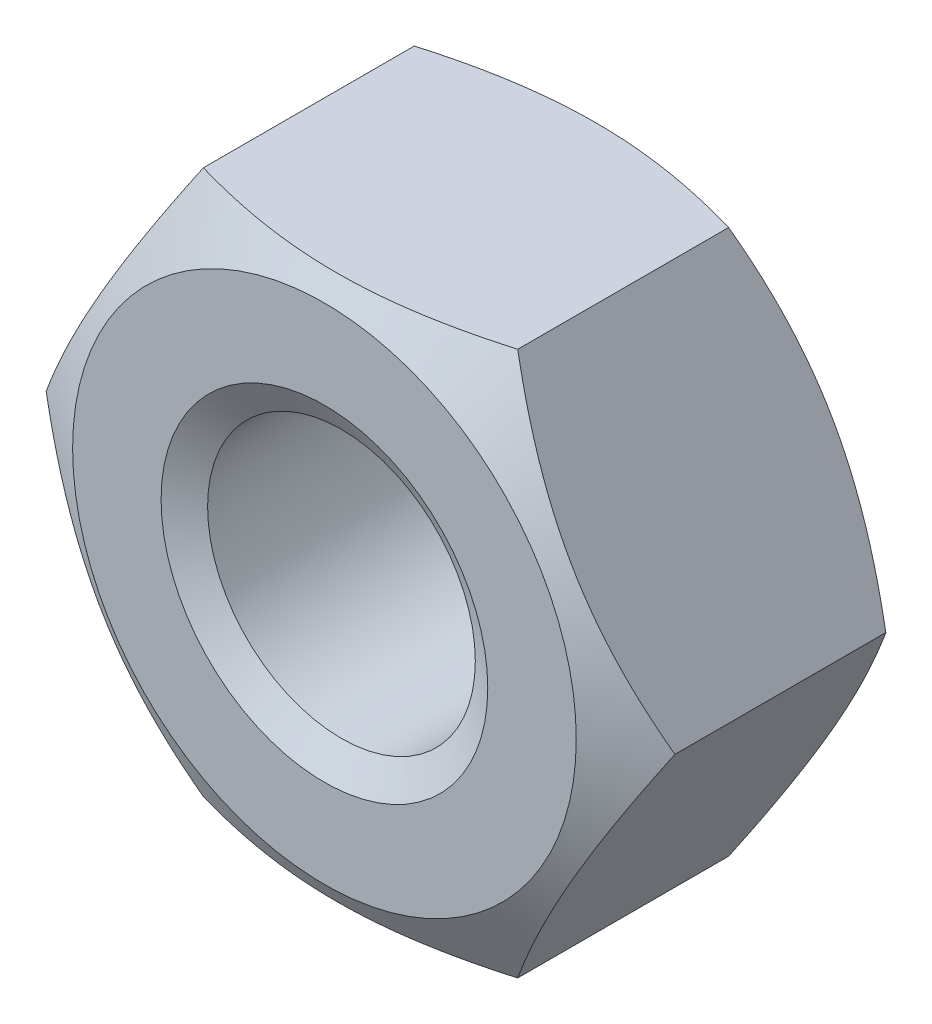
ISO-10303-21;
HEADER;
FILE_DESCRIPTION(('STEP AP214'),'2;1');
FILE_NAME('part.step','',(''),(''),'','','');
FILE_SCHEMA(('AUTOMOTIVE_DESIGN { 1 0 10303 214 1 1 1 1 }'));
ENDSEC;
DATA;
#1=APPLICATION_CONTEXT('core data for automotive mechanical design processes');
#2=APPLICATION_PROTOCOL_DEFINITION('international standard','automotive_design',2000,#1);
#3=PRODUCT_CONTEXT('',#1,'mechanical');
#4=PRODUCT('Part','Part','',(#3));
#5=PRODUCT_RELATED_PRODUCT_CATEGORY('part','',(#4));
#6=PRODUCT_DEFINITION_FORMATION('','',#4);
#7=PRODUCT_DEFINITION_CONTEXT('part definition',#1,'design');
#8=PRODUCT_DEFINITION('design','',#6,#7);
#9=PRODUCT_DEFINITION_SHAPE('','',#8);
#10=(LENGTH_UNIT() NAMED_UNIT(*) SI_UNIT(.MILLI.,.METRE.));
#11=(NAMED_UNIT(*) PLANE_ANGLE_UNIT() SI_UNIT($,.RADIAN.));
#12=(NAMED_UNIT(*) SI_UNIT($,.STERADIAN.) SOLID_ANGLE_UNIT());
#13=UNCERTAINTY_MEASURE_WITH_UNIT(LENGTH_MEASURE(1.E-05),#10,'distance_accuracy_value','');
#14=(GEOMETRIC_REPRESENTATION_CONTEXT(3) GLOBAL_UNCERTAINTY_ASSIGNED_CONTEXT((#13)) GLOBAL_UNIT_ASSIGNED_CONTEXT((#10,
#11,#12)) REPRESENTATION_CONTEXT('',''));
#15=CARTESIAN_POINT('',(0.,0.,0.));
#16=DIRECTION('',(0.,0.,1.));
#17=DIRECTION('',(1.,0.,0.));
#18=AXIS2_PLACEMENT_3D('',#15,#16,#17);
#19=CARTESIAN_POINT('',(2.88675134594813,-5.,-5.2));
#20=DIRECTION('',(0.866025403784439,-0.5,0.));
#21=DIRECTION('',(0.5,0.866025403784439,0.));
#22=AXIS2_PLACEMENT_3D('',#19,#20,#21);
#23=PLANE('',#22);
#24=CARTESIAN_POINT('',(2.88663587589429,-5.0002,-0.663155006997931));
#25=CARTESIAN_POINT('',(3.01349970319368,-4.78046540547481,-0.589892918583738));
#26=CARTESIAN_POINT('',(3.14144859993849,-4.55885141554042,-0.523257672864196));
#27=CARTESIAN_POINT('',(3.39956193532121,-4.11178600454649,-0.406945341956916));
#28=CARTESIAN_POINT('',(3.52973095989718,-3.88632664040923,-0.357309400861895));
#29=CARTESIAN_POINT('',(3.78847564779798,-3.43816769477649,-0.280057376364805));
#30=CARTESIAN_POINT('',(3.91701101576052,-3.21553790689581,-0.251926729229597));
#31=CARTESIAN_POINT('',(4.11026620624323,-2.88081009815336,-0.226701272899792));
#32=CARTESIAN_POINT('',(4.17472868879311,-2.76915780319494,-0.221119810715592));
#33=CARTESIAN_POINT('',(4.30371322717528,-2.5457500293262,-0.215708567697578));
#34=CARTESIAN_POINT('',(4.36823528110589,-2.43399455370969,-0.215878609204311));
#35=CARTESIAN_POINT('',(4.54500768479194,-2.12781576914936,-0.224259982738144));
#36=CARTESIAN_POINT('',(4.65719946015293,-1.93349391403279,-0.238336122843359));
#37=CARTESIAN_POINT('',(4.88083840557981,-1.5461398980023,-0.282971608055538));
#38=CARTESIAN_POINT('',(4.9922847895602,-1.35310909862843,-0.313546211093615));
#39=CARTESIAN_POINT('',(5.21637431361295,-0.964974657525147,-0.38997484456727));
#40=CARTESIAN_POINT('',(5.32898917185759,-0.769920001358265,-0.436152729824786));
#41=CARTESIAN_POINT('',(5.55253939626498,-0.382719654641232,-0.540958145438039));
#42=CARTESIAN_POINT('',(5.66347762579592,-0.190569004591913,-0.599561054383479));
#43=CARTESIAN_POINT('',(5.7736181619501,0.000200000000000737,-0.663155006997933));
#44=B_SPLINE_CURVE_WITH_KNOTS('',3,(#24,#25,#26,#27,#28,#29,#30,#31,#32,#33,#34,#35,#36,#37,#38,
#39,#40,#41,#42,#43),.UNSPECIFIED.,.F.,.F.,(4,2,2,2,2,2,2,2,2,4),(0.,0.792555841363089,
1.58701660053333,2.3618153748728,2.74884076077325,3.13585419177295,3.80962362599679,
4.48401723901189,5.17336882348928,5.86136694793725),.UNSPECIFIED.);
#45=CARTESIAN_POINT('',(2.88675134594813,-5.,-0.663088338331305));
#46=VERTEX_POINT('',#45);
#47=CARTESIAN_POINT('',(5.77350269189626,0.,-0.663088338331305));
#48=VERTEX_POINT('',#47);
#49=EDGE_CURVE('E51',#46,#48,#44,.T.);
#50=ORIENTED_EDGE('',*,*,#49,.F.);
#51=DIRECTION('',(0.,0.,1.));
#52=VECTOR('',#51,1.);
#53=CARTESIAN_POINT('',(2.88675134594813,-5.,-5.2));
#54=LINE('',#53,#52);
#55=CARTESIAN_POINT('',(2.88675134594813,-5.,-4.53691166166869));
#56=VERTEX_POINT('',#55);
#57=EDGE_CURVE('E115',#56,#46,#54,.T.);
#58=ORIENTED_EDGE('',*,*,#57,.F.);
#59=CARTESIAN_POINT('',(5.7736181619501,0.000200000000000384,-4.53684499300207));
#60=CARTESIAN_POINT('',(5.64675433465071,-0.219534594525185,-4.61010708141626));
#61=CARTESIAN_POINT('',(5.5188054379059,-0.44114858445958,-4.6767423271358));
#62=CARTESIAN_POINT('',(5.26069210252318,-0.888213995453513,-4.79305465804308));
#63=CARTESIAN_POINT('',(5.13052307794721,-1.11367335959077,-4.8426905991381));
#64=CARTESIAN_POINT('',(4.87177839004641,-1.56183230522351,-4.91994262363519));
#65=CARTESIAN_POINT('',(4.74324302208387,-1.78446209310419,-4.9480732707704));
#66=CARTESIAN_POINT('',(4.54998783160116,-2.11918990184664,-4.97329872710021));
#67=CARTESIAN_POINT('',(4.48552534905128,-2.23084219680506,-4.97888018928441));
#68=CARTESIAN_POINT('',(4.35654081066911,-2.4542499706738,-4.98429143230242));
#69=CARTESIAN_POINT('',(4.2920187567385,-2.56600544629031,-4.98412139079569));
#70=CARTESIAN_POINT('',(4.11524635305245,-2.87218423085064,-4.97574001726186));
#71=CARTESIAN_POINT('',(4.00305457769146,-3.06650608596721,-4.96166387715664));
#72=CARTESIAN_POINT('',(3.77941563226458,-3.4538601019977,-4.91702839194446));
#73=CARTESIAN_POINT('',(3.66796924828419,-3.64689090137157,-4.88645378890638));
#74=CARTESIAN_POINT('',(3.44387972423144,-4.03502534247485,-4.81002515543273));
#75=CARTESIAN_POINT('',(3.3312648659868,-4.23007999864173,-4.76384727017521));
#76=CARTESIAN_POINT('',(3.10771464157941,-4.61728034535877,-4.65904185456196));
#77=CARTESIAN_POINT('',(2.99677641204847,-4.80943099540809,-4.60043894561652));
#78=CARTESIAN_POINT('',(2.88663587589429,-5.0002,-4.53684499300207));
#79=B_SPLINE_CURVE_WITH_KNOTS('',3,(#59,#60,#61,#62,#63,#64,#65,#66,#67,#68,#69,#70,#71,#72,#73,
#74,#75,#76,#77,#78),.UNSPECIFIED.,.F.,.F.,(4,2,2,2,2,2,2,2,2,4),(0.,0.79255584136309,
1.58701660053333,2.3618153748728,2.74884076077325,3.13585419177295,3.80962362599679,
4.48401723901189,5.17336882348928,5.86136694793725),.UNSPECIFIED.);
#80=CARTESIAN_POINT('',(5.77350269189626,0.,-4.53691166166869));
#81=VERTEX_POINT('',#80);
#82=EDGE_CURVE('E126',#81,#56,#79,.T.);
#83=ORIENTED_EDGE('',*,*,#82,.F.);
#84=DIRECTION('',(0.,0.,1.));
#85=VECTOR('',#84,1.);
#86=CARTESIAN_POINT('',(5.77350269189626,0.,-5.2));
#87=LINE('',#86,#85);
#88=EDGE_CURVE('E123',#81,#48,#87,.T.);
#89=ORIENTED_EDGE('',*,*,#88,.T.);
#90=EDGE_LOOP('',(#50,#58,#83,#89));
#91=FACE_BOUND('',#90,.T.);
#92=ADVANCED_FACE('F36',(#91),#23,.T.);
#93=CARTESIAN_POINT('',(-2.88675134594813,-5.,-5.2));
#94=DIRECTION('',(0.,-1.,0.));
#95=DIRECTION('',(0.,0.,-1.));
#96=AXIS2_PLACEMENT_3D('',#93,#94,#95);
#97=PLANE('',#96);
#98=CARTESIAN_POINT('',(-7.62610109642657,-5.,-2.59465189961733));
#99=CARTESIAN_POINT('',(-7.40680462387157,-5.,-2.48880064655454));
#100=CARTESIAN_POINT('',(-7.18698625319056,-5.,-2.38401087554829));
#101=CARTESIAN_POINT('',(-6.74602337963763,-5.,-2.17716157604716));
#102=CARTESIAN_POINT('',(-6.5248786519794,-5.,-2.07510252732497));
#103=CARTESIAN_POINT('',(-6.07977122145086,-5.,-1.87377772298819));
#104=CARTESIAN_POINT('',(-5.85579961499066,-5.,-1.7745315804738));
#105=CARTESIAN_POINT('',(-5.40600442176888,-5.,-1.58034558991326));
#106=CARTESIAN_POINT('',(-5.18018093332123,-5.,-1.48540551498911));
#107=CARTESIAN_POINT('',(-4.72365957742319,-5.,-1.29990810802235));
#108=CARTESIAN_POINT('',(-4.49293557407721,-5.,-1.20941474238578));
#109=CARTESIAN_POINT('',(-4.0287555357453,-5.,-1.03559062317218));
#110=CARTESIAN_POINT('',(-3.79529919900584,-5.,-0.952260669352542));
#111=CARTESIAN_POINT('',(-3.32577267957493,-5.,-0.795024367942578));
#112=CARTESIAN_POINT('',(-3.08970936568518,-5.,-0.721097720567049));
#113=CARTESIAN_POINT('',(-2.61422832862103,-5.,-0.585088280679047));
#114=CARTESIAN_POINT('',(-2.37481170005247,-5.,-0.523001715725234));
#115=CARTESIAN_POINT('',(-1.89244856776129,-5.,-0.413702737543138));
#116=CARTESIAN_POINT('',(-1.64950078161834,-5.,-0.366495876945352));
#117=CARTESIAN_POINT('',(-1.16070996598629,-5.,-0.290160243949609));
#118=CARTESIAN_POINT('',(-0.914866928294787,-5.,-0.261031522780502));
#119=CARTESIAN_POINT('',(-0.423107003526084,-5.,-0.223429734101214));
#120=CARTESIAN_POINT('',(-0.177200128378448,-5.,-0.21482904798375));
#121=CARTESIAN_POINT('',(0.314391860281714,-5.,-0.218726959851281));
#122=CARTESIAN_POINT('',(0.560077014096605,-5.,-0.231220233916041));
#123=CARTESIAN_POINT('',(0.980468232916883,-5.,-0.26977191210304));
#124=CARTESIAN_POINT('',(1.15564068945729,-5.,-0.291007824000625));
#125=CARTESIAN_POINT('',(1.50461161321748,-5.,-0.342806673261787));
#126=CARTESIAN_POINT('',(1.67840986865903,-5.,-0.37337102055831));
#127=CARTESIAN_POINT('',(2.19802325603685,-5.,-0.477533886990484));
#128=CARTESIAN_POINT('',(2.54137550131329,-5.,-0.563531808073423));
#129=CARTESIAN_POINT('',(3.05491771823626,-5.,-0.711561468799112));
#130=CARTESIAN_POINT('',(3.22779534181989,-5.,-0.76479094948456));
#131=CARTESIAN_POINT('',(3.57188016810637,-5.,-0.876495029428238));
#132=CARTESIAN_POINT('',(3.74308721989283,-5.,-0.934970097787196));
#133=CARTESIAN_POINT('',(4.08297609926364,-5.,-1.05591692981487));
#134=CARTESIAN_POINT('',(4.25166673667091,-5.,-1.11836418481148));
#135=CARTESIAN_POINT('',(4.58761682064634,-5.,-1.24683492900998));
#136=CARTESIAN_POINT('',(4.75487673996795,-5.,-1.3128571795353));
#137=CARTESIAN_POINT('',(4.92153493264754,-5.,-1.38033134642848));
#138=B_SPLINE_CURVE_WITH_KNOTS('',3,(#98,#99,#100,#101,#102,#103,#104,#105,#106,#107,#108,#109,
#110,#111,#112,#113,#114,#115,#116,#117,#118,#119,#120,#121,#122,#123,#124,#125,#126,#127,#128,
#129,#130,#131,#132,#133,#134,#135,#136,#137),.UNSPECIFIED.,.F.,.F.,(4,2,2,2,2,2,2,2,2,2,2,2,2,
2,2,2,2,2,2,4),(0.,0.730529566724559,1.46118665165218,2.19607764026717,2.93092986387477,
3.67434556130396,4.41784414969813,5.15970940795047,5.90133789959201,6.64324281655146,
7.38514983587115,8.12243241795256,8.85952894455192,9.38863514952208,9.9178213651246,
10.9782399869672,11.5208585190152,12.0635256246456,12.6031195929073,13.1425277824729),.UNSPECIFIED.);
#139=CARTESIAN_POINT('',(-2.88675134594813,-5.,-0.663088338331305));
#140=VERTEX_POINT('',#139);
#141=EDGE_CURVE('E108',#140,#46,#138,.T.);
#142=ORIENTED_EDGE('',*,*,#141,.F.);
#143=DIRECTION('',(0.,0.,1.));
#144=VECTOR('',#143,1.);
#145=CARTESIAN_POINT('',(-2.88675134594813,-5.,-5.2));
#146=LINE('',#145,#144);
#147=CARTESIAN_POINT('',(-2.88675134594813,-5.,-4.53691166166869));
#148=VERTEX_POINT('',#147);
#149=EDGE_CURVE('E107',#148,#140,#146,.T.);
#150=ORIENTED_EDGE('',*,*,#149,.F.);
#151=CARTESIAN_POINT('',(-7.62610109642657,-5.,-2.60534810038267));
#152=CARTESIAN_POINT('',(-7.40680462387157,-5.,-2.71119935344546));
#153=CARTESIAN_POINT('',(-7.18698625319056,-5.,-2.81598912445171));
#154=CARTESIAN_POINT('',(-6.74602337963763,-5.,-3.02283842395284));
#155=CARTESIAN_POINT('',(-6.5248786519794,-5.,-3.12489747267503));
#156=CARTESIAN_POINT('',(-6.07977122145086,-5.,-3.32622227701181));
#157=CARTESIAN_POINT('',(-5.85579961499066,-5.,-3.4254684195262));
#158=CARTESIAN_POINT('',(-5.40600442176888,-5.,-3.61965441008674));
#159=CARTESIAN_POINT('',(-5.18018093332123,-5.,-3.71459448501088));
#160=CARTESIAN_POINT('',(-4.72365957742319,-5.,-3.90009189197765));
#161=CARTESIAN_POINT('',(-4.49293557407721,-5.,-3.99058525761422));
#162=CARTESIAN_POINT('',(-4.0287555357453,-5.,-4.16440937682782));
#163=CARTESIAN_POINT('',(-3.79529919900584,-5.,-4.24773933064746));
#164=CARTESIAN_POINT('',(-3.32577267957493,-5.,-4.40497563205742));
#165=CARTESIAN_POINT('',(-3.08970936568518,-5.,-4.47890227943295));
#166=CARTESIAN_POINT('',(-2.61422832862103,-5.,-4.61491171932095));
#167=CARTESIAN_POINT('',(-2.37481170005247,-5.,-4.67699828427477));
#168=CARTESIAN_POINT('',(-1.89244856776129,-5.,-4.78629726245686));
#169=CARTESIAN_POINT('',(-1.64950078161834,-5.,-4.83350412305465));
#170=CARTESIAN_POINT('',(-1.16070996598629,-5.,-4.90983975605039));
#171=CARTESIAN_POINT('',(-0.914866928294787,-5.,-4.9389684772195));
#172=CARTESIAN_POINT('',(-0.423107003526084,-5.,-4.97657026589879));
#173=CARTESIAN_POINT('',(-0.177200128378447,-5.,-4.98517095201625));
#174=CARTESIAN_POINT('',(0.314391860281715,-5.,-4.98127304014872));
#175=CARTESIAN_POINT('',(0.560077014096606,-5.,-4.96877976608396));
#176=CARTESIAN_POINT('',(0.980468232916884,-5.,-4.93022808789696));
#177=CARTESIAN_POINT('',(1.15564068945729,-5.,-4.90899217599937));
#178=CARTESIAN_POINT('',(1.50461161321748,-5.,-4.85719332673821));
#179=CARTESIAN_POINT('',(1.67840986865903,-5.,-4.82662897944169));
#180=CARTESIAN_POINT('',(2.19802325603685,-5.,-4.72246611300952));
#181=CARTESIAN_POINT('',(2.54137550131329,-5.,-4.63646819192658));
#182=CARTESIAN_POINT('',(3.05491771823626,-5.,-4.48843853120089));
#183=CARTESIAN_POINT('',(3.22779534181989,-5.,-4.43520905051544));
#184=CARTESIAN_POINT('',(3.57188016810636,-5.,-4.32350497057176));
#185=CARTESIAN_POINT('',(3.74308721989283,-5.,-4.26502990221281));
#186=CARTESIAN_POINT('',(4.08297609926364,-5.,-4.14408307018513));
#187=CARTESIAN_POINT('',(4.25166673667091,-5.,-4.08163581518852));
#188=CARTESIAN_POINT('',(4.58761682064633,-5.,-3.95316507099002));
#189=CARTESIAN_POINT('',(4.75487673996794,-5.,-3.8871428204647));
#190=CARTESIAN_POINT('',(4.92153493264753,-5.,-3.81966865357152));
#191=B_SPLINE_CURVE_WITH_KNOTS('',3,(#151,#152,#153,#154,#155,#156,#157,#158,#159,#160,#161,
#162,#163,#164,#165,#166,#167,#168,#169,#170,#171,#172,#173,#174,#175,#176,#177,#178,#179,#180,
#181,#182,#183,#184,#185,#186,#187,#188,#189,#190),.UNSPECIFIED.,.F.,.F.,(4,2,2,2,2,2,2,2,2,2,2,
2,2,2,2,2,2,2,2,4),(0.,0.730529566724559,1.46118665165218,2.19607764026717,2.93092986387478,
3.67434556130396,4.41784414969813,5.15970940795047,5.90133789959201,6.64324281655146,
7.38514983587115,8.12243241795256,8.85952894455192,9.38863514952208,9.9178213651246,
10.9782399869672,11.5208585190152,12.0635256246456,12.6031195929073,13.1425277824729),.UNSPECIFIED.);
#192=EDGE_CURVE('E197',#56,#148,#191,.F.);
#193=ORIENTED_EDGE('',*,*,#192,.F.);
#194=ORIENTED_EDGE('',*,*,#57,.T.);
#195=EDGE_LOOP('',(#142,#150,#193,#194));
#196=FACE_BOUND('',#195,.T.);
#197=ADVANCED_FACE('F205',(#196),#97,.T.);
#198=CARTESIAN_POINT('',(-5.77350269189626,0.,-5.2));
#199=DIRECTION('',(-0.866025403784438,-0.5,0.));
#200=DIRECTION('',(0.5,-0.866025403784439,0.));
#201=AXIS2_PLACEMENT_3D('',#198,#199,#200);
#202=PLANE('',#201);
#203=CARTESIAN_POINT('',(-5.7736181619501,0.000199999999999141,-0.663155006997931));
#204=CARTESIAN_POINT('',(-5.64675433465071,-0.219534594525186,-0.589892918583738));
#205=CARTESIAN_POINT('',(-5.5188054379059,-0.441148584459581,-0.523257672864196));
#206=CARTESIAN_POINT('',(-5.26069210252318,-0.888213995453513,-0.406945341956916));
#207=CARTESIAN_POINT('',(-5.13052307794721,-1.11367335959077,-0.357309400861894));
#208=CARTESIAN_POINT('',(-4.87177839004641,-1.56183230522351,-0.280057376364804));
#209=CARTESIAN_POINT('',(-4.74324302208387,-1.78446209310419,-0.251926729229595));
#210=CARTESIAN_POINT('',(-4.54998783160116,-2.11918990184664,-0.226701272899791));
#211=CARTESIAN_POINT('',(-4.48552534905128,-2.23084219680506,-0.22111981071559));
#212=CARTESIAN_POINT('',(-4.35654081066911,-2.4542499706738,-0.215708567697577));
#213=CARTESIAN_POINT('',(-4.2920187567385,-2.56600544629031,-0.21587860920431));
#214=CARTESIAN_POINT('',(-4.11524635305244,-2.87218423085064,-0.224259982738143));
#215=CARTESIAN_POINT('',(-4.00305457769146,-3.06650608596721,-0.238336122843358));
#216=CARTESIAN_POINT('',(-3.77941563226457,-3.4538601019977,-0.282971608055536));
#217=CARTESIAN_POINT('',(-3.66796924828418,-3.64689090137157,-0.313546211093613));
#218=CARTESIAN_POINT('',(-3.44387972423144,-4.03502534247485,-0.389974844567268));
#219=CARTESIAN_POINT('',(-3.3312648659868,-4.23007999864173,-0.436152729824784));
#220=CARTESIAN_POINT('',(-3.1077146415794,-4.61728034535877,-0.540958145438037));
#221=CARTESIAN_POINT('',(-2.99677641204847,-4.80943099540809,-0.599561054383477));
#222=CARTESIAN_POINT('',(-2.88663587589429,-5.0002,-0.66315500699793));
#223=B_SPLINE_CURVE_WITH_KNOTS('',3,(#203,#204,#205,#206,#207,#208,#209,#210,#211,#212,#213,
#214,#215,#216,#217,#218,#219,#220,#221,#222),.UNSPECIFIED.,.F.,.F.,(4,2,2,2,2,2,2,2,2,4),(0.,
0.79255584136309,1.58701660053333,2.3618153748728,2.74884076077325,3.13585419177295,
3.80962362599679,4.48401723901189,5.17336882348928,5.86136694793725),.UNSPECIFIED.);
#224=CARTESIAN_POINT('',(-5.77350269189626,0.,-0.663088338331305));
#225=VERTEX_POINT('',#224);
#226=EDGE_CURVE('E91',#225,#140,#223,.T.);
#227=ORIENTED_EDGE('',*,*,#226,.F.);
#228=DIRECTION('',(0.,0.,1.));
#229=VECTOR('',#228,1.);
#230=CARTESIAN_POINT('',(-5.77350269189626,0.,-5.2));
#231=LINE('',#230,#229);
#232=CARTESIAN_POINT('',(-5.77350269189626,0.,-4.53691166166869));
#233=VERTEX_POINT('',#232);
#234=EDGE_CURVE('E105',#233,#225,#231,.T.);
#235=ORIENTED_EDGE('',*,*,#234,.F.);
#236=CARTESIAN_POINT('',(-2.88663587589429,-5.0002,-4.53684499300207));
#237=CARTESIAN_POINT('',(-3.01349970319368,-4.78046540547481,-4.61010708141626));
#238=CARTESIAN_POINT('',(-3.14144859993849,-4.55885141554042,-4.6767423271358));
#239=CARTESIAN_POINT('',(-3.39956193532121,-4.11178600454649,-4.79305465804308));
#240=CARTESIAN_POINT('',(-3.52973095989718,-3.88632664040923,-4.84269059913811));
#241=CARTESIAN_POINT('',(-3.78847564779797,-3.43816769477649,-4.9199426236352));
#242=CARTESIAN_POINT('',(-3.91701101576052,-3.21553790689581,-4.9480732707704));
#243=CARTESIAN_POINT('',(-4.11026620624322,-2.88081009815336,-4.97329872710021));
#244=CARTESIAN_POINT('',(-4.17472868879311,-2.76915780319494,-4.97888018928441));
#245=CARTESIAN_POINT('',(-4.30371322717528,-2.5457500293262,-4.98429143230242));
#246=CARTESIAN_POINT('',(-4.36823528110589,-2.43399455370969,-4.98412139079569));
#247=CARTESIAN_POINT('',(-4.54500768479194,-2.12781576914936,-4.97574001726186));
#248=CARTESIAN_POINT('',(-4.65719946015292,-1.93349391403279,-4.96166387715664));
#249=CARTESIAN_POINT('',(-4.88083840557981,-1.54613989800229,-4.91702839194446));
#250=CARTESIAN_POINT('',(-4.9922847895602,-1.35310909862843,-4.88645378890639));
#251=CARTESIAN_POINT('',(-5.21637431361295,-0.964974657525146,-4.81002515543273));
#252=CARTESIAN_POINT('',(-5.32898917185759,-0.769920001358265,-4.76384727017521));
#253=CARTESIAN_POINT('',(-5.55253939626498,-0.382719654641232,-4.65904185456196));
#254=CARTESIAN_POINT('',(-5.66347762579592,-0.190569004591914,-4.60043894561652));
#255=CARTESIAN_POINT('',(-5.7736181619501,0.00019999999999921,-4.53684499300207));
#256=B_SPLINE_CURVE_WITH_KNOTS('',3,(#236,#237,#238,#239,#240,#241,#242,#243,#244,#245,#246,
#247,#248,#249,#250,#251,#252,#253,#254,#255),.UNSPECIFIED.,.F.,.F.,(4,2,2,2,2,2,2,2,2,4),(0.,
0.792555841363091,1.58701660053333,2.3618153748728,2.74884076077325,3.13585419177295,
3.80962362599679,4.48401723901189,5.17336882348928,5.86136694793725),.UNSPECIFIED.);
#257=EDGE_CURVE('E191',#148,#233,#256,.T.);
#258=ORIENTED_EDGE('',*,*,#257,.F.);
#259=ORIENTED_EDGE('',*,*,#149,.T.);
#260=EDGE_LOOP('',(#227,#235,#258,#259));
#261=FACE_BOUND('',#260,.T.);
#262=ADVANCED_FACE('F103',(#261),#202,.T.);
#263=CARTESIAN_POINT('',(-2.88675134594813,5.,-5.2));
#264=DIRECTION('',(-0.866025403784439,0.5,0.));
#265=DIRECTION('',(-0.5,-0.866025403784439,0.));
#266=AXIS2_PLACEMENT_3D('',#263,#264,#265);
#267=PLANE('',#266);
#268=CARTESIAN_POINT('',(-2.88663587589429,5.0002,-0.66315500699793));
#269=CARTESIAN_POINT('',(-3.01349970319368,4.78046540547481,-0.589892918583737));
#270=CARTESIAN_POINT('',(-3.14144859993849,4.55885141554042,-0.523257672864195));
#271=CARTESIAN_POINT('',(-3.39956193532121,4.11178600454649,-0.406945341956915));
#272=CARTESIAN_POINT('',(-3.52973095989718,3.88632664040923,-0.357309400861894));
#273=CARTESIAN_POINT('',(-3.78847564779797,3.43816769477649,-0.280057376364803));
#274=CARTESIAN_POINT('',(-3.91701101576052,3.21553790689581,-0.251926729229595));
#275=CARTESIAN_POINT('',(-4.11026620624322,2.88081009815336,-0.226701272899791));
#276=CARTESIAN_POINT('',(-4.17472868879311,2.76915780319494,-0.22111981071559));
#277=CARTESIAN_POINT('',(-4.30371322717528,2.5457500293262,-0.215708567697577));
#278=CARTESIAN_POINT('',(-4.36823528110588,2.43399455370969,-0.21587860920431));
#279=CARTESIAN_POINT('',(-4.54500768479194,2.12781576914936,-0.224259982738143));
#280=CARTESIAN_POINT('',(-4.65719946015292,1.93349391403279,-0.238336122843358));
#281=CARTESIAN_POINT('',(-4.88083840557981,1.5461398980023,-0.282971608055537));
#282=CARTESIAN_POINT('',(-4.9922847895602,1.35310909862843,-0.313546211093614));
#283=CARTESIAN_POINT('',(-5.21637431361295,0.964974657525146,-0.389974844567269));
#284=CARTESIAN_POINT('',(-5.32898917185759,0.769920001358264,-0.436152729824785));
#285=CARTESIAN_POINT('',(-5.55253939626498,0.382719654641231,-0.540958145438038));
#286=CARTESIAN_POINT('',(-5.66347762579592,0.190569004591913,-0.599561054383477));
#287=CARTESIAN_POINT('',(-5.7736181619501,-0.000200000000001021,-0.663155006997931));
#288=B_SPLINE_CURVE_WITH_KNOTS('',3,(#268,#269,#270,#271,#272,#273,#274,#275,#276,#277,#278,
#279,#280,#281,#282,#283,#284,#285,#286,#287),.UNSPECIFIED.,.F.,.F.,(4,2,2,2,2,2,2,2,2,4),(0.,
0.79255584136309,1.58701660053333,2.3618153748728,2.74884076077325,3.13585419177294,
3.80962362599679,4.48401723901189,5.17336882348928,5.86136694793725),.UNSPECIFIED.);
#289=CARTESIAN_POINT('',(-2.88675134594813,5.,-0.663088338331305));
#290=VERTEX_POINT('',#289);
#291=EDGE_CURVE('E87',#290,#225,#288,.T.);
#292=ORIENTED_EDGE('',*,*,#291,.F.);
#293=DIRECTION('',(0.,0.,1.));
#294=VECTOR('',#293,1.);
#295=CARTESIAN_POINT('',(-2.88675134594813,5.,-5.2));
#296=LINE('',#295,#294);
#297=CARTESIAN_POINT('',(-2.88675134594813,5.,-4.53691166166869));
#298=VERTEX_POINT('',#297);
#299=EDGE_CURVE('E113',#298,#290,#296,.T.);
#300=ORIENTED_EDGE('',*,*,#299,.F.);
#301=CARTESIAN_POINT('',(-5.7736181619501,-0.000200000000000898,-4.53684499300207));
#302=CARTESIAN_POINT('',(-5.64675433465071,0.219534594525184,-4.61010708141626));
#303=CARTESIAN_POINT('',(-5.5188054379059,0.441148584459579,-4.6767423271358));
#304=CARTESIAN_POINT('',(-5.26069210252318,0.888213995453512,-4.79305465804308));
#305=CARTESIAN_POINT('',(-5.13052307794721,1.11367335959077,-4.8426905991381));
#306=CARTESIAN_POINT('',(-4.87177839004641,1.56183230522351,-4.9199426236352));
#307=CARTESIAN_POINT('',(-4.74324302208387,1.78446209310419,-4.94807327077041));
#308=CARTESIAN_POINT('',(-4.54998783160116,2.11918990184664,-4.97329872710021));
#309=CARTESIAN_POINT('',(-4.48552534905128,2.23084219680506,-4.97888018928441));
#310=CARTESIAN_POINT('',(-4.35654081066911,2.45424997067379,-4.98429143230242));
#311=CARTESIAN_POINT('',(-4.2920187567385,2.56600544629031,-4.98412139079569));
#312=CARTESIAN_POINT('',(-4.11524635305244,2.87218423085064,-4.97574001726186));
#313=CARTESIAN_POINT('',(-4.00305457769146,3.06650608596721,-4.96166387715664));
#314=CARTESIAN_POINT('',(-3.77941563226457,3.4538601019977,-4.91702839194446));
#315=CARTESIAN_POINT('',(-3.66796924828418,3.64689090137157,-4.88645378890639));
#316=CARTESIAN_POINT('',(-3.44387972423144,4.03502534247485,-4.81002515543273));
#317=CARTESIAN_POINT('',(-3.3312648659868,4.23007999864173,-4.76384727017522));
#318=CARTESIAN_POINT('',(-3.1077146415794,4.61728034535877,-4.65904185456196));
#319=CARTESIAN_POINT('',(-2.99677641204847,4.80943099540809,-4.60043894561652));
#320=CARTESIAN_POINT('',(-2.88663587589429,5.0002,-4.53684499300207));
#321=B_SPLINE_CURVE_WITH_KNOTS('',3,(#301,#302,#303,#304,#305,#306,#307,#308,#309,#310,#311,
#312,#313,#314,#315,#316,#317,#318,#319,#320),.UNSPECIFIED.,.F.,.F.,(4,2,2,2,2,2,2,2,2,4),(0.,
0.79255584136309,1.58701660053333,2.3618153748728,2.74884076077325,3.13585419177295,
3.80962362599679,4.48401723901189,5.17336882348928,5.86136694793725),.UNSPECIFIED.);
#322=EDGE_CURVE('E112',#233,#298,#321,.T.);
#323=ORIENTED_EDGE('',*,*,#322,.F.);
#324=ORIENTED_EDGE('',*,*,#234,.T.);
#325=EDGE_LOOP('',(#292,#300,#323,#324));
#326=FACE_BOUND('',#325,.T.);
#327=ADVANCED_FACE('F111',(#326),#267,.T.);
#328=CARTESIAN_POINT('',(2.88675134594813,5.,-5.2));
#329=DIRECTION('',(0.,1.,0.));
#330=DIRECTION('',(-1.,0.,0.));
#331=AXIS2_PLACEMENT_3D('',#328,#329,#330);
#332=PLANE('',#331);
#333=CARTESIAN_POINT('',(-7.62610109642657,5.,-2.59465189961733));
#334=CARTESIAN_POINT('',(-7.40680462387157,5.,-2.48880064655454));
#335=CARTESIAN_POINT('',(-7.18698625319056,5.,-2.38401087554829));
#336=CARTESIAN_POINT('',(-6.74602337963763,5.,-2.17716157604716));
#337=CARTESIAN_POINT('',(-6.5248786519794,5.,-2.07510252732497));
#338=CARTESIAN_POINT('',(-6.07977122145086,5.,-1.87377772298819));
#339=CARTESIAN_POINT('',(-5.85579961499066,5.,-1.7745315804738));
#340=CARTESIAN_POINT('',(-5.40600442176888,5.,-1.58034558991326));
#341=CARTESIAN_POINT('',(-5.18018093332122,5.,-1.48540551498911));
#342=CARTESIAN_POINT('',(-4.72365957742319,5.,-1.29990810802235));
#343=CARTESIAN_POINT('',(-4.49293557407721,5.,-1.20941474238578));
#344=CARTESIAN_POINT('',(-4.0287555357453,5.,-1.03559062317218));
#345=CARTESIAN_POINT('',(-3.79529919900583,5.,-0.952260669352541));
#346=CARTESIAN_POINT('',(-3.32577267957493,5.,-0.795024367942577));
#347=CARTESIAN_POINT('',(-3.08970936568518,5.,-0.721097720567048));
#348=CARTESIAN_POINT('',(-2.61422832862103,5.,-0.585088280679047));
#349=CARTESIAN_POINT('',(-2.37481170005247,5.,-0.523001715725233));
#350=CARTESIAN_POINT('',(-1.89244856776129,5.,-0.413702737543138));
#351=CARTESIAN_POINT('',(-1.64950078161834,5.,-0.366495876945352));
#352=CARTESIAN_POINT('',(-1.16070996598629,5.,-0.29016024394961));
#353=CARTESIAN_POINT('',(-0.914866928294787,5.,-0.261031522780502));
#354=CARTESIAN_POINT('',(-0.423107003526085,5.,-0.223429734101214));
#355=CARTESIAN_POINT('',(-0.177200128378449,5.,-0.21482904798375));
#356=CARTESIAN_POINT('',(0.314391860281714,5.,-0.218726959851281));
#357=CARTESIAN_POINT('',(0.560077014096605,5.,-0.231220233916041));
#358=CARTESIAN_POINT('',(0.980468232916882,5.,-0.26977191210304));
#359=CARTESIAN_POINT('',(1.15564068945729,5.,-0.291007824000625));
#360=CARTESIAN_POINT('',(1.50461161321748,5.,-0.342806673261787));
#361=CARTESIAN_POINT('',(1.67840986865903,5.,-0.37337102055831));
#362=CARTESIAN_POINT('',(2.19802325603685,5.,-0.477533886990485));
#363=CARTESIAN_POINT('',(2.54137550131329,5.,-0.563531808073423));
#364=CARTESIAN_POINT('',(3.05491771823626,5.,-0.711561468799112));
#365=CARTESIAN_POINT('',(3.22779534181989,5.,-0.76479094948456));
#366=CARTESIAN_POINT('',(3.57188016810637,5.,-0.876495029428238));
#367=CARTESIAN_POINT('',(3.74308721989283,5.,-0.934970097787196));
#368=CARTESIAN_POINT('',(4.08297609926364,5.,-1.05591692981487));
#369=CARTESIAN_POINT('',(4.25166673667091,5.,-1.11836418481148));
#370=CARTESIAN_POINT('',(4.58761682064634,5.,-1.24683492900998));
#371=CARTESIAN_POINT('',(4.75487673996795,5.,-1.3128571795353));
#372=CARTESIAN_POINT('',(4.92153493264754,5.,-1.38033134642848));
#373=B_SPLINE_CURVE_WITH_KNOTS('',3,(#333,#334,#335,#336,#337,#338,#339,#340,#341,#342,#343,
#344,#345,#346,#347,#348,#349,#350,#351,#352,#353,#354,#355,#356,#357,#358,#359,#360,#361,#362,
#363,#364,#365,#366,#367,#368,#369,#370,#371,#372),.UNSPECIFIED.,.F.,.F.,(4,2,2,2,2,2,2,2,2,2,2,
2,2,2,2,2,2,2,2,4),(0.,0.730529566724559,1.46118665165218,2.19607764026717,2.93092986387478,
3.67434556130396,4.41784414969813,5.15970940795047,5.90133789959201,6.64324281655146,
7.38514983587115,8.12243241795256,8.85952894455192,9.38863514952208,9.9178213651246,
10.9782399869672,11.5208585190153,12.0635256246456,12.6031195929073,13.1425277824729),.UNSPECIFIED.);
#374=CARTESIAN_POINT('',(2.88675134594813,5.,-0.663088338331305));
#375=VERTEX_POINT('',#374);
#376=EDGE_CURVE('E94',#375,#290,#373,.F.);
#377=ORIENTED_EDGE('',*,*,#376,.F.);
#378=DIRECTION('',(0.,0.,1.));
#379=VECTOR('',#378,1.);
#380=CARTESIAN_POINT('',(2.88675134594813,5.,-5.2));
#381=LINE('',#380,#379);
#382=CARTESIAN_POINT('',(2.88675134594813,5.,-4.53691166166869));
#383=VERTEX_POINT('',#382);
#384=EDGE_CURVE('E117',#383,#375,#381,.T.);
#385=ORIENTED_EDGE('',*,*,#384,.F.);
#386=CARTESIAN_POINT('',(-7.62610109642657,5.,-2.60534810038267));
#387=CARTESIAN_POINT('',(-7.40680462387157,5.,-2.71119935344546));
#388=CARTESIAN_POINT('',(-7.18698625319056,5.,-2.81598912445171));
#389=CARTESIAN_POINT('',(-6.74602337963763,5.,-3.02283842395284));
#390=CARTESIAN_POINT('',(-6.5248786519794,5.,-3.12489747267503));
#391=CARTESIAN_POINT('',(-6.07977122145086,5.,-3.32622227701181));
#392=CARTESIAN_POINT('',(-5.85579961499066,5.,-3.4254684195262));
#393=CARTESIAN_POINT('',(-5.40600442176888,5.,-3.61965441008674));
#394=CARTESIAN_POINT('',(-5.18018093332123,5.,-3.71459448501088));
#395=CARTESIAN_POINT('',(-4.72365957742319,5.,-3.90009189197765));
#396=CARTESIAN_POINT('',(-4.49293557407722,5.,-3.99058525761422));
#397=CARTESIAN_POINT('',(-4.0287555357453,5.,-4.16440937682782));
#398=CARTESIAN_POINT('',(-3.79529919900584,5.,-4.24773933064746));
#399=CARTESIAN_POINT('',(-3.32577267957493,5.,-4.40497563205742));
#400=CARTESIAN_POINT('',(-3.08970936568518,5.,-4.47890227943295));
#401=CARTESIAN_POINT('',(-2.61422832862103,5.,-4.61491171932095));
#402=CARTESIAN_POINT('',(-2.37481170005247,5.,-4.67699828427476));
#403=CARTESIAN_POINT('',(-1.89244856776129,5.,-4.78629726245686));
#404=CARTESIAN_POINT('',(-1.64950078161834,5.,-4.83350412305465));
#405=CARTESIAN_POINT('',(-1.16070996598629,5.,-4.90983975605039));
#406=CARTESIAN_POINT('',(-0.914866928294787,5.,-4.9389684772195));
#407=CARTESIAN_POINT('',(-0.423107003526084,5.,-4.97657026589879));
#408=CARTESIAN_POINT('',(-0.177200128378448,5.,-4.98517095201625));
#409=CARTESIAN_POINT('',(0.314391860281715,5.,-4.98127304014872));
#410=CARTESIAN_POINT('',(0.560077014096606,5.,-4.96877976608396));
#411=CARTESIAN_POINT('',(0.980468232916883,5.,-4.93022808789696));
#412=CARTESIAN_POINT('',(1.15564068945729,5.,-4.90899217599937));
#413=CARTESIAN_POINT('',(1.50461161321748,5.,-4.85719332673821));
#414=CARTESIAN_POINT('',(1.67840986865903,5.,-4.82662897944169));
#415=CARTESIAN_POINT('',(2.19802325603685,5.,-4.72246611300952));
#416=CARTESIAN_POINT('',(2.54137550131329,5.,-4.63646819192658));
#417=CARTESIAN_POINT('',(3.05491771823626,5.,-4.48843853120089));
#418=CARTESIAN_POINT('',(3.22779534181989,5.,-4.43520905051544));
#419=CARTESIAN_POINT('',(3.57188016810636,5.,-4.32350497057176));
#420=CARTESIAN_POINT('',(3.74308721989283,5.,-4.2650299022128));
#421=CARTESIAN_POINT('',(4.08297609926363,5.,-4.14408307018513));
#422=CARTESIAN_POINT('',(4.2516667366709,5.,-4.08163581518852));
#423=CARTESIAN_POINT('',(4.58761682064633,5.,-3.95316507099002));
#424=CARTESIAN_POINT('',(4.75487673996794,5.,-3.8871428204647));
#425=CARTESIAN_POINT('',(4.92153493264753,5.,-3.81966865357152));
#426=B_SPLINE_CURVE_WITH_KNOTS('',3,(#386,#387,#388,#389,#390,#391,#392,#393,#394,#395,#396,
#397,#398,#399,#400,#401,#402,#403,#404,#405,#406,#407,#408,#409,#410,#411,#412,#413,#414,#415,
#416,#417,#418,#419,#420,#421,#422,#423,#424,#425),.UNSPECIFIED.,.F.,.F.,(4,2,2,2,2,2,2,2,2,2,2,
2,2,2,2,2,2,2,2,4),(0.,0.730529566724558,1.46118665165218,2.19607764026716,2.93092986387477,
3.67434556130395,4.41784414969813,5.15970940795047,5.90133789959201,6.64324281655146,
7.38514983587115,8.12243241795256,8.85952894455192,9.38863514952208,9.9178213651246,
10.9782399869672,11.5208585190152,12.0635256246456,12.6031195929073,13.1425277824729),.UNSPECIFIED.);
#427=EDGE_CURVE('E59',#298,#383,#426,.T.);
#428=ORIENTED_EDGE('',*,*,#427,.F.);
#429=ORIENTED_EDGE('',*,*,#299,.T.);
#430=EDGE_LOOP('',(#377,#385,#428,#429));
#431=FACE_BOUND('',#430,.T.);
#432=ADVANCED_FACE('F228',(#431),#332,.T.);
#433=CARTESIAN_POINT('',(5.77350269189626,0.,-5.2));
#434=DIRECTION('',(0.866025403784438,0.5,0.));
#435=DIRECTION('',(-0.5,0.866025403784439,0.));
#436=AXIS2_PLACEMENT_3D('',#433,#434,#435);
#437=PLANE('',#436);
#438=CARTESIAN_POINT('',(5.7736181619501,-0.000199999999999683,-0.663155006997932));
#439=CARTESIAN_POINT('',(5.64675433465071,0.219534594525185,-0.589892918583739));
#440=CARTESIAN_POINT('',(5.5188054379059,0.44114858445958,-0.523257672864197));
#441=CARTESIAN_POINT('',(5.26069210252318,0.888213995453513,-0.406945341956917));
#442=CARTESIAN_POINT('',(5.13052307794721,1.11367335959077,-0.357309400861895));
#443=CARTESIAN_POINT('',(4.87177839004641,1.56183230522351,-0.280057376364805));
#444=CARTESIAN_POINT('',(4.74324302208387,1.78446209310419,-0.251926729229597));
#445=CARTESIAN_POINT('',(4.54998783160117,2.11918990184664,-0.226701272899792));
#446=CARTESIAN_POINT('',(4.48552534905128,2.23084219680506,-0.221119810715591));
#447=CARTESIAN_POINT('',(4.35654081066911,2.4542499706738,-0.215708567697577));
#448=CARTESIAN_POINT('',(4.2920187567385,2.56600544629031,-0.215878609204311));
#449=CARTESIAN_POINT('',(4.11524635305245,2.87218423085064,-0.224259982738144));
#450=CARTESIAN_POINT('',(4.00305457769146,3.06650608596721,-0.238336122843359));
#451=CARTESIAN_POINT('',(3.77941563226458,3.4538601019977,-0.282971608055538));
#452=CARTESIAN_POINT('',(3.66796924828419,3.64689090137157,-0.313546211093614));
#453=CARTESIAN_POINT('',(3.44387972423144,4.03502534247485,-0.389974844567269));
#454=CARTESIAN_POINT('',(3.3312648659868,4.23007999864174,-0.436152729824785));
#455=CARTESIAN_POINT('',(3.1077146415794,4.61728034535877,-0.540958145438038));
#456=CARTESIAN_POINT('',(2.99677641204847,4.80943099540809,-0.599561054383478));
#457=CARTESIAN_POINT('',(2.88663587589429,5.0002,-0.663155006997931));
#458=B_SPLINE_CURVE_WITH_KNOTS('',3,(#438,#439,#440,#441,#442,#443,#444,#445,#446,#447,#448,
#449,#450,#451,#452,#453,#454,#455,#456,#457),.UNSPECIFIED.,.F.,.F.,(4,2,2,2,2,2,2,2,2,4),(0.,
0.792555841363089,1.58701660053333,2.3618153748728,2.74884076077325,3.13585419177295,
3.80962362599679,4.48401723901189,5.17336882348929,5.86136694793725),.UNSPECIFIED.);
#459=EDGE_CURVE('E250',#48,#375,#458,.T.);
#460=ORIENTED_EDGE('',*,*,#459,.F.);
#461=ORIENTED_EDGE('',*,*,#88,.F.);
#462=CARTESIAN_POINT('',(2.88663587589429,5.0002,-4.53684499300207));
#463=CARTESIAN_POINT('',(3.01349970319368,4.78046540547482,-4.61010708141626));
#464=CARTESIAN_POINT('',(3.14144859993849,4.55885141554042,-4.6767423271358));
#465=CARTESIAN_POINT('',(3.39956193532121,4.11178600454649,-4.79305465804308));
#466=CARTESIAN_POINT('',(3.52973095989718,3.88632664040923,-4.8426905991381));
#467=CARTESIAN_POINT('',(3.78847564779798,3.43816769477649,-4.91994262363519));
#468=CARTESIAN_POINT('',(3.91701101576052,3.21553790689581,-4.9480732707704));
#469=CARTESIAN_POINT('',(4.11026620624322,2.88081009815336,-4.97329872710021));
#470=CARTESIAN_POINT('',(4.17472868879311,2.76915780319494,-4.97888018928441));
#471=CARTESIAN_POINT('',(4.30371322717528,2.5457500293262,-4.98429143230242));
#472=CARTESIAN_POINT('',(4.36823528110589,2.43399455370969,-4.98412139079569));
#473=CARTESIAN_POINT('',(4.54500768479194,2.12781576914936,-4.97574001726186));
#474=CARTESIAN_POINT('',(4.65719946015293,1.93349391403279,-4.96166387715664));
#475=CARTESIAN_POINT('',(4.88083840557981,1.5461398980023,-4.91702839194446));
#476=CARTESIAN_POINT('',(4.9922847895602,1.35310909862843,-4.88645378890638));
#477=CARTESIAN_POINT('',(5.21637431361295,0.964974657525147,-4.81002515543273));
#478=CARTESIAN_POINT('',(5.32898917185759,0.769920001358265,-4.76384727017521));
#479=CARTESIAN_POINT('',(5.55253939626498,0.382719654641232,-4.65904185456196));
#480=CARTESIAN_POINT('',(5.66347762579592,0.190569004591914,-4.60043894561652));
#481=CARTESIAN_POINT('',(5.7736181619501,-0.000199999999999416,-4.53684499300207));
#482=B_SPLINE_CURVE_WITH_KNOTS('',3,(#462,#463,#464,#465,#466,#467,#468,#469,#470,#471,#472,
#473,#474,#475,#476,#477,#478,#479,#480,#481),.UNSPECIFIED.,.F.,.F.,(4,2,2,2,2,2,2,2,2,4),(0.,
0.792555841363089,1.58701660053333,2.3618153748728,2.74884076077325,3.13585419177295,
3.80962362599679,4.48401723901189,5.17336882348929,5.86136694793725),.UNSPECIFIED.);
#483=EDGE_CURVE('E153',#383,#81,#482,.T.);
#484=ORIENTED_EDGE('',*,*,#483,.F.);
#485=ORIENTED_EDGE('',*,*,#384,.T.);
#486=EDGE_LOOP('',(#460,#461,#484,#485));
#487=FACE_BOUND('',#486,.T.);
#488=ADVANCED_FACE('F147',(#487),#437,.T.);
#489=CARTESIAN_POINT('',(5.77350269189626,0.,-5.2));
#490=DIRECTION('',(0.,0.,1.));
#491=DIRECTION('',(1.,0.,0.));
#492=AXIS2_PLACEMENT_3D('',#489,#490,#491);
#493=PLANE('',#492);
#494=CARTESIAN_POINT('',(0.,0.,-5.2));
#495=DIRECTION('',(0.,0.,1.));
#496=DIRECTION('',(1.,0.,0.));
#497=AXIS2_PLACEMENT_3D('',#494,#495,#496);
#498=CIRCLE('',#497,2.77113517076618);
#499=CARTESIAN_POINT('',(2.77113517076618,0.,-5.2));
#500=VERTEX_POINT('',#499);
#501=EDGE_CURVE('E127',#500,#500,#498,.T.);
#502=ORIENTED_EDGE('',*,*,#501,.T.);
#503=EDGE_LOOP('',(#502));
#504=FACE_BOUND('',#503,.T.);
#505=CARTESIAN_POINT('',(0.,0.,-5.2));
#506=DIRECTION('',(0.,0.,-1.));
#507=DIRECTION('',(-1.,0.,0.));
#508=AXIS2_PLACEMENT_3D('',#505,#506,#507);
#509=CIRCLE('',#508,4.625);
#510=CARTESIAN_POINT('',(-4.625,0.,-5.2));
#511=VERTEX_POINT('',#510);
#512=EDGE_CURVE('E151',#511,#511,#509,.T.);
#513=ORIENTED_EDGE('',*,*,#512,.T.);
#514=EDGE_LOOP('',(#513));
#515=FACE_BOUND('',#514,.T.);
#516=ADVANCED_FACE('F143',(#504,#515),#493,.F.);
#517=CARTESIAN_POINT('',(5.77350269189626,0.,0.));
#518=DIRECTION('',(0.,0.,1.));
#519=DIRECTION('',(1.,0.,0.));
#520=AXIS2_PLACEMENT_3D('',#517,#518,#519);
#521=PLANE('',#520);
#522=CARTESIAN_POINT('',(0.,0.,0.));
#523=DIRECTION('',(0.,0.,1.));
#524=DIRECTION('',(1.,0.,0.));
#525=AXIS2_PLACEMENT_3D('',#522,#523,#524);
#526=CIRCLE('',#525,3.00000000000001);
#527=CARTESIAN_POINT('',(3.00000000000001,0.,0.));
#528=VERTEX_POINT('',#527);
#529=EDGE_CURVE('E11',#528,#528,#526,.F.);
#530=ORIENTED_EDGE('',*,*,#529,.T.);
#531=EDGE_LOOP('',(#530));
#532=FACE_BOUND('',#531,.T.);
#533=CARTESIAN_POINT('',(0.,0.,0.));
#534=DIRECTION('',(0.,0.,-1.));
#535=DIRECTION('',(-1.,0.,0.));
#536=AXIS2_PLACEMENT_3D('',#533,#534,#535);
#537=CIRCLE('',#536,4.625);
#538=CARTESIAN_POINT('',(-4.625,0.,0.));
#539=VERTEX_POINT('',#538);
#540=EDGE_CURVE('E251',#539,#539,#537,.T.);
#541=ORIENTED_EDGE('',*,*,#540,.F.);
#542=EDGE_LOOP('',(#541));
#543=FACE_BOUND('',#542,.T.);
#544=ADVANCED_FACE('F146',(#532,#543),#521,.T.);
#545=CARTESIAN_POINT('',(0.,0.,-5.2));
#546=DIRECTION('',(0.,0.,1.));
#547=DIRECTION('',(1.,0.,0.));
#548=AXIS2_PLACEMENT_3D('',#545,#546,#547);
#549=CYLINDRICAL_SURFACE('',#548,2.4585);
#550=CARTESIAN_POINT('',(0.,0.,-4.6585));
#551=DIRECTION('',(0.,0.,1.));
#552=DIRECTION('',(1.,0.,0.));
#553=AXIS2_PLACEMENT_3D('',#550,#551,#552);
#554=CIRCLE('',#553,2.4585);
#555=CARTESIAN_POINT('',(2.4585,0.,-4.6585));
#556=VERTEX_POINT('',#555);
#557=EDGE_CURVE('E44',#556,#556,#554,.F.);
#558=ORIENTED_EDGE('',*,*,#557,.T.);
#559=EDGE_LOOP('',(#558));
#560=FACE_BOUND('',#559,.T.);
#561=CARTESIAN_POINT('',(0.,0.,-0.312635170766185));
#562=DIRECTION('',(0.,0.,1.));
#563=DIRECTION('',(1.,0.,0.));
#564=AXIS2_PLACEMENT_3D('',#561,#562,#563);
#565=CIRCLE('',#564,2.4585);
#566=CARTESIAN_POINT('',(2.4585,0.,-0.312635170766185));
#567=VERTEX_POINT('',#566);
#568=EDGE_CURVE('E130',#567,#567,#565,.T.);
#569=ORIENTED_EDGE('',*,*,#568,.T.);
#570=EDGE_LOOP('',(#569));
#571=FACE_BOUND('',#570,.T.);
#572=ADVANCED_FACE('F135',(#560,#571),#549,.F.);
#573=CARTESIAN_POINT('',(0.,0.,-4.53691166166869));
#574=DIRECTION('',(0.,0.,1.));
#575=DIRECTION('',(1.,0.,0.));
#576=AXIS2_PLACEMENT_3D('',#573,#574,#575);
#577=CONICAL_SURFACE('',#576,5.77350269189626,1.0471975511966);
#578=ORIENTED_EDGE('',*,*,#82,.T.);
#579=ORIENTED_EDGE('',*,*,#192,.T.);
#580=ORIENTED_EDGE('',*,*,#257,.T.);
#581=ORIENTED_EDGE('',*,*,#322,.T.);
#582=ORIENTED_EDGE('',*,*,#427,.T.);
#583=ORIENTED_EDGE('',*,*,#483,.T.);
#584=EDGE_LOOP('',(#578,#579,#580,#581,#582,#583));
#585=FACE_BOUND('',#584,.T.);
#586=ORIENTED_EDGE('',*,*,#512,.F.);
#587=EDGE_LOOP('',(#586));
#588=FACE_BOUND('',#587,.T.);
#589=ADVANCED_FACE('F175',(#585,#588),#577,.T.);
#590=CARTESIAN_POINT('',(0.,0.,0.));
#591=DIRECTION('',(0.,0.,-1.));
#592=DIRECTION('',(-1.,0.,0.));
#593=AXIS2_PLACEMENT_3D('',#590,#591,#592);
#594=CONICAL_SURFACE('',#593,4.625,1.0471975511966);
#595=ORIENTED_EDGE('',*,*,#49,.T.);
#596=ORIENTED_EDGE('',*,*,#459,.T.);
#597=ORIENTED_EDGE('',*,*,#376,.T.);
#598=ORIENTED_EDGE('',*,*,#291,.T.);
#599=ORIENTED_EDGE('',*,*,#226,.T.);
#600=ORIENTED_EDGE('',*,*,#141,.T.);
#601=EDGE_LOOP('',(#595,#596,#597,#598,#599,#600));
#602=FACE_BOUND('',#601,.T.);
#603=ORIENTED_EDGE('',*,*,#540,.T.);
#604=EDGE_LOOP('',(#603));
#605=FACE_BOUND('',#604,.T.);
#606=ADVANCED_FACE('F89',(#602,#605),#594,.T.);
#607=CARTESIAN_POINT('',(0.,0.,-5.2));
#608=DIRECTION('',(0.,0.,-1.));
#609=DIRECTION('',(-1.,0.,0.));
#610=AXIS2_PLACEMENT_3D('',#607,#608,#609);
#611=CONICAL_SURFACE('',#610,2.77113517076618,0.523598775598298);
#612=ORIENTED_EDGE('',*,*,#557,.F.);
#613=EDGE_LOOP('',(#612));
#614=FACE_BOUND('',#613,.T.);
#615=ORIENTED_EDGE('',*,*,#501,.F.);
#616=EDGE_LOOP('',(#615));
#617=FACE_BOUND('',#616,.T.);
#618=ADVANCED_FACE('F138',(#614,#617),#611,.F.);
#619=CARTESIAN_POINT('',(0.,0.,-0.312635170766185));
#620=DIRECTION('',(0.,0.,1.));
#621=DIRECTION('',(1.,0.,0.));
#622=AXIS2_PLACEMENT_3D('',#619,#620,#621);
#623=CONICAL_SURFACE('',#622,2.4585,1.0471975511966);
#624=ORIENTED_EDGE('',*,*,#529,.F.);
#625=EDGE_LOOP('',(#624));
#626=FACE_BOUND('',#625,.T.);
#627=ORIENTED_EDGE('',*,*,#568,.F.);
#628=EDGE_LOOP('',(#627));
#629=FACE_BOUND('',#628,.T.);
#630=ADVANCED_FACE('F38',(#626,#629),#623,.F.);
#631=CLOSED_SHELL('',(#92,#197,#262,#327,#432,#488,#516,#544,#572,#589,#606,#618,#630));
#632=MANIFOLD_SOLID_BREP('B2',#631);
#633=ADVANCED_BREP_SHAPE_REPRESENTATION('',(#18,#632),#14);
#634=SHAPE_DEFINITION_REPRESENTATION(#9,#633);
ENDSEC;
END-ISO-10303-21;
